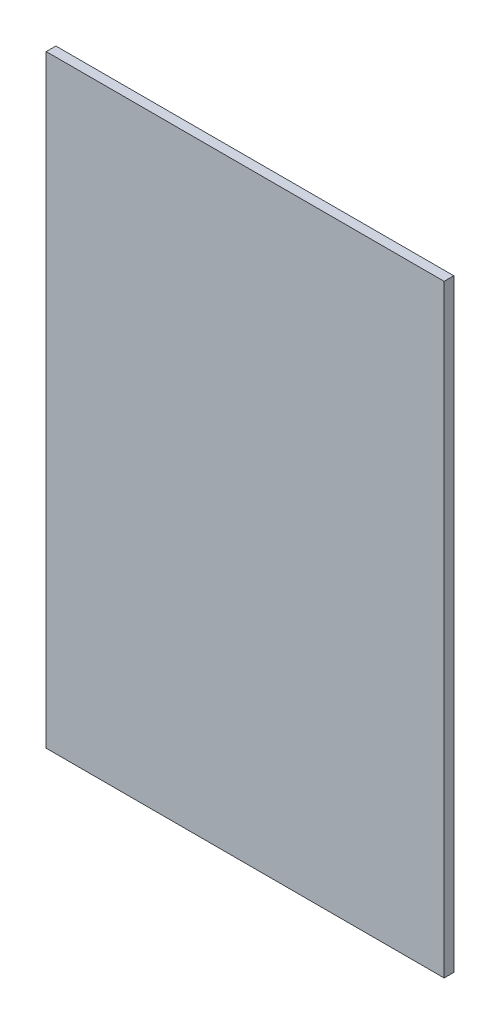
ISO-10303-21;
HEADER;
FILE_DESCRIPTION(('STEP AP214'),'2;1');
FILE_NAME('part.step','',(''),(''),'','','');
FILE_SCHEMA(('AUTOMOTIVE_DESIGN { 1 0 10303 214 1 1 1 1 }'));
ENDSEC;
DATA;
#1=APPLICATION_CONTEXT('core data for automotive mechanical design processes');
#2=APPLICATION_PROTOCOL_DEFINITION('international standard','automotive_design',2000,#1);
#3=PRODUCT_CONTEXT('',#1,'mechanical');
#4=PRODUCT('Part','Part','',(#3));
#5=PRODUCT_RELATED_PRODUCT_CATEGORY('part','',(#4));
#6=PRODUCT_DEFINITION_FORMATION('','',#4);
#7=PRODUCT_DEFINITION_CONTEXT('part definition',#1,'design');
#8=PRODUCT_DEFINITION('design','',#6,#7);
#9=PRODUCT_DEFINITION_SHAPE('','',#8);
#10=(LENGTH_UNIT() NAMED_UNIT(*) SI_UNIT(.MILLI.,.METRE.));
#11=(NAMED_UNIT(*) PLANE_ANGLE_UNIT() SI_UNIT($,.RADIAN.));
#12=(NAMED_UNIT(*) SI_UNIT($,.STERADIAN.) SOLID_ANGLE_UNIT());
#13=UNCERTAINTY_MEASURE_WITH_UNIT(LENGTH_MEASURE(1.E-05),#10,'distance_accuracy_value','');
#14=(GEOMETRIC_REPRESENTATION_CONTEXT(3) GLOBAL_UNCERTAINTY_ASSIGNED_CONTEXT((#13)) GLOBAL_UNIT_ASSIGNED_CONTEXT((#10,
#11,#12)) REPRESENTATION_CONTEXT('',''));
#15=CARTESIAN_POINT('',(0.,0.,0.));
#16=DIRECTION('',(0.,0.,1.));
#17=DIRECTION('',(1.,0.,0.));
#18=AXIS2_PLACEMENT_3D('',#15,#16,#17);
#19=CARTESIAN_POINT('',(2.032,2.032,-2.032));
#20=DIRECTION('',(-1.,0.,0.));
#21=DIRECTION('',(0.,0.,1.));
#22=AXIS2_PLACEMENT_3D('',#19,#20,#21);
#23=PLANE('',#22);
#24=DIRECTION('',(0.,-1.,0.));
#25=VECTOR('',#24,1.);
#26=CARTESIAN_POINT('',(2.032,2.032,0.));
#27=LINE('',#26,#25);
#28=CARTESIAN_POINT('',(2.032,129.032,0.));
#29=VERTEX_POINT('',#28);
#30=CARTESIAN_POINT('',(2.032,2.032,0.));
#31=VERTEX_POINT('',#30);
#32=EDGE_CURVE('E97',#29,#31,#27,.T.);
#33=ORIENTED_EDGE('',*,*,#32,.F.);
#34=DIRECTION('',(0.,0.,1.));
#35=VECTOR('',#34,1.);
#36=CARTESIAN_POINT('',(2.032,129.032,-2.032));
#37=LINE('',#36,#35);
#38=CARTESIAN_POINT('',(2.032,129.032,-2.032));
#39=VERTEX_POINT('',#38);
#40=EDGE_CURVE('E11',#39,#29,#37,.T.);
#41=ORIENTED_EDGE('',*,*,#40,.F.);
#42=DIRECTION('',(0.,-1.,0.));
#43=VECTOR('',#42,1.);
#44=CARTESIAN_POINT('',(2.032,2.032,-2.032));
#45=LINE('',#44,#43);
#46=CARTESIAN_POINT('',(2.032,2.032,-2.032));
#47=VERTEX_POINT('',#46);
#48=EDGE_CURVE('E91',#39,#47,#45,.T.);
#49=ORIENTED_EDGE('',*,*,#48,.T.);
#50=DIRECTION('',(0.,0.,1.));
#51=VECTOR('',#50,1.);
#52=CARTESIAN_POINT('',(2.032,2.032,-2.032));
#53=LINE('',#52,#51);
#54=EDGE_CURVE('E36',#47,#31,#53,.T.);
#55=ORIENTED_EDGE('',*,*,#54,.T.);
#56=EDGE_LOOP('',(#33,#41,#49,#55));
#57=FACE_BOUND('',#56,.T.);
#58=ADVANCED_FACE('F33',(#57),#23,.T.);
#59=CARTESIAN_POINT('',(2.032,129.032,-2.032));
#60=DIRECTION('',(0.,1.,0.));
#61=DIRECTION('',(0.,0.,1.));
#62=AXIS2_PLACEMENT_3D('',#59,#60,#61);
#63=PLANE('',#62);
#64=DIRECTION('',(-1.,0.,0.));
#65=VECTOR('',#64,1.);
#66=CARTESIAN_POINT('',(2.032,129.032,0.));
#67=LINE('',#66,#65);
#68=CARTESIAN_POINT('',(85.796,129.032,0.));
#69=VERTEX_POINT('',#68);
#70=EDGE_CURVE('E93',#69,#29,#67,.T.);
#71=ORIENTED_EDGE('',*,*,#70,.F.);
#72=DIRECTION('',(0.,0.,1.));
#73=VECTOR('',#72,1.);
#74=CARTESIAN_POINT('',(85.796,129.032,-2.032));
#75=LINE('',#74,#73);
#76=CARTESIAN_POINT('',(85.796,129.032,-2.032));
#77=VERTEX_POINT('',#76);
#78=EDGE_CURVE('E42',#77,#69,#75,.T.);
#79=ORIENTED_EDGE('',*,*,#78,.F.);
#80=DIRECTION('',(-1.,0.,0.));
#81=VECTOR('',#80,1.);
#82=CARTESIAN_POINT('',(2.032,129.032,-2.032));
#83=LINE('',#82,#81);
#84=EDGE_CURVE('E88',#77,#39,#83,.T.);
#85=ORIENTED_EDGE('',*,*,#84,.T.);
#86=ORIENTED_EDGE('',*,*,#40,.T.);
#87=EDGE_LOOP('',(#71,#79,#85,#86));
#88=FACE_BOUND('',#87,.T.);
#89=ADVANCED_FACE('F107',(#88),#63,.T.);
#90=CARTESIAN_POINT('',(85.796,2.032,-2.032));
#91=DIRECTION('',(1.,0.,0.));
#92=DIRECTION('',(0.,0.,-1.));
#93=AXIS2_PLACEMENT_3D('',#90,#91,#92);
#94=PLANE('',#93);
#95=DIRECTION('',(0.,1.,0.));
#96=VECTOR('',#95,1.);
#97=CARTESIAN_POINT('',(85.796,2.032,0.));
#98=LINE('',#97,#96);
#99=CARTESIAN_POINT('',(85.796,2.032,0.));
#100=VERTEX_POINT('',#99);
#101=EDGE_CURVE('E83',#100,#69,#98,.T.);
#102=ORIENTED_EDGE('',*,*,#101,.F.);
#103=DIRECTION('',(0.,0.,1.));
#104=VECTOR('',#103,1.);
#105=CARTESIAN_POINT('',(85.796,2.032,-2.032));
#106=LINE('',#105,#104);
#107=CARTESIAN_POINT('',(85.796,2.032,-2.032));
#108=VERTEX_POINT('',#107);
#109=EDGE_CURVE('E78',#108,#100,#106,.T.);
#110=ORIENTED_EDGE('',*,*,#109,.F.);
#111=DIRECTION('',(0.,1.,0.));
#112=VECTOR('',#111,1.);
#113=CARTESIAN_POINT('',(85.796,2.032,-2.032));
#114=LINE('',#113,#112);
#115=EDGE_CURVE('E81',#108,#77,#114,.T.);
#116=ORIENTED_EDGE('',*,*,#115,.T.);
#117=ORIENTED_EDGE('',*,*,#78,.T.);
#118=EDGE_LOOP('',(#102,#110,#116,#117));
#119=FACE_BOUND('',#118,.T.);
#120=ADVANCED_FACE('F80',(#119),#94,.T.);
#121=CARTESIAN_POINT('',(2.032,2.032,-2.032));
#122=DIRECTION('',(0.,-1.,0.));
#123=DIRECTION('',(0.,0.,-1.));
#124=AXIS2_PLACEMENT_3D('',#121,#122,#123);
#125=PLANE('',#124);
#126=DIRECTION('',(1.,0.,0.));
#127=VECTOR('',#126,1.);
#128=CARTESIAN_POINT('',(2.032,2.032,0.));
#129=LINE('',#128,#127);
#130=EDGE_CURVE('E100',#31,#100,#129,.T.);
#131=ORIENTED_EDGE('',*,*,#130,.F.);
#132=ORIENTED_EDGE('',*,*,#54,.F.);
#133=DIRECTION('',(1.,0.,0.));
#134=VECTOR('',#133,1.);
#135=CARTESIAN_POINT('',(2.032,2.032,-2.032));
#136=LINE('',#135,#134);
#137=EDGE_CURVE('E87',#47,#108,#136,.T.);
#138=ORIENTED_EDGE('',*,*,#137,.T.);
#139=ORIENTED_EDGE('',*,*,#109,.T.);
#140=EDGE_LOOP('',(#131,#132,#138,#139));
#141=FACE_BOUND('',#140,.T.);
#142=ADVANCED_FACE('F90',(#141),#125,.T.);
#143=CARTESIAN_POINT('',(0.,0.,-2.032));
#144=DIRECTION('',(0.,0.,-1.));
#145=DIRECTION('',(-1.,0.,0.));
#146=AXIS2_PLACEMENT_3D('',#143,#144,#145);
#147=PLANE('',#146);
#148=ORIENTED_EDGE('',*,*,#48,.F.);
#149=ORIENTED_EDGE('',*,*,#84,.F.);
#150=ORIENTED_EDGE('',*,*,#115,.F.);
#151=ORIENTED_EDGE('',*,*,#137,.F.);
#152=EDGE_LOOP('',(#148,#149,#150,#151));
#153=FACE_BOUND('',#152,.T.);
#154=ADVANCED_FACE('F86',(#153),#147,.T.);
#155=CARTESIAN_POINT('',(0.,0.,0.));
#156=DIRECTION('',(0.,0.,-1.));
#157=DIRECTION('',(-1.,0.,0.));
#158=AXIS2_PLACEMENT_3D('',#155,#156,#157);
#159=PLANE('',#158);
#160=ORIENTED_EDGE('',*,*,#32,.T.);
#161=ORIENTED_EDGE('',*,*,#130,.T.);
#162=ORIENTED_EDGE('',*,*,#101,.T.);
#163=ORIENTED_EDGE('',*,*,#70,.T.);
#164=EDGE_LOOP('',(#160,#161,#162,#163));
#165=FACE_BOUND('',#164,.T.);
#166=ADVANCED_FACE('F106',(#165),#159,.F.);
#167=CLOSED_SHELL('',(#58,#89,#120,#142,#154,#166));
#168=MANIFOLD_SOLID_BREP('B2',#167);
#169=ADVANCED_BREP_SHAPE_REPRESENTATION('',(#18,#168),#14);
#170=SHAPE_DEFINITION_REPRESENTATION(#9,#169);
ENDSEC;
END-ISO-10303-21;
